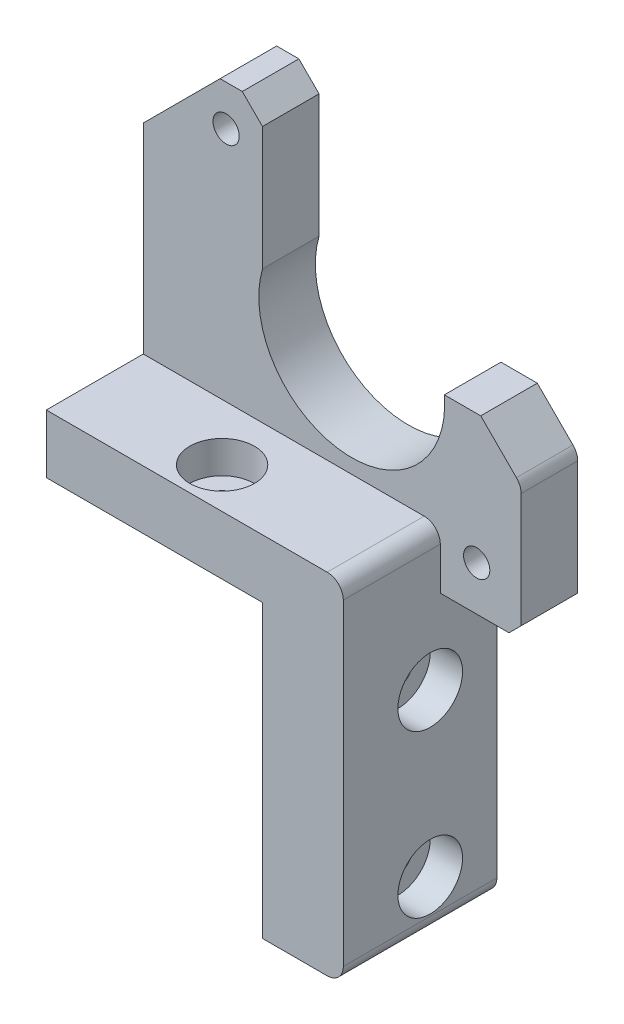
ISO-10303-21;
HEADER;
FILE_DESCRIPTION(('STEP AP214'),'2;1');
FILE_NAME('part.step','',(''),(''),'','','');
FILE_SCHEMA(('AUTOMOTIVE_DESIGN { 1 0 10303 214 1 1 1 1 }'));
ENDSEC;
DATA;
#1=APPLICATION_CONTEXT('core data for automotive mechanical design processes');
#2=APPLICATION_PROTOCOL_DEFINITION('international standard','automotive_design',2000,#1);
#3=PRODUCT_CONTEXT('',#1,'mechanical');
#4=PRODUCT('Part','Part','',(#3));
#5=PRODUCT_RELATED_PRODUCT_CATEGORY('part','',(#4));
#6=PRODUCT_DEFINITION_FORMATION('','',#4);
#7=PRODUCT_DEFINITION_CONTEXT('part definition',#1,'design');
#8=PRODUCT_DEFINITION('design','',#6,#7);
#9=PRODUCT_DEFINITION_SHAPE('','',#8);
#10=(LENGTH_UNIT() NAMED_UNIT(*) SI_UNIT(.MILLI.,.METRE.));
#11=(NAMED_UNIT(*) PLANE_ANGLE_UNIT() SI_UNIT($,.RADIAN.));
#12=(NAMED_UNIT(*) SI_UNIT($,.STERADIAN.) SOLID_ANGLE_UNIT());
#13=UNCERTAINTY_MEASURE_WITH_UNIT(LENGTH_MEASURE(1.E-05),#10,'distance_accuracy_value','');
#14=(GEOMETRIC_REPRESENTATION_CONTEXT(3) GLOBAL_UNCERTAINTY_ASSIGNED_CONTEXT((#13)) GLOBAL_UNIT_ASSIGNED_CONTEXT((#10,
#11,#12)) REPRESENTATION_CONTEXT('',''));
#15=CARTESIAN_POINT('',(0.,0.,0.));
#16=DIRECTION('',(0.,0.,1.));
#17=DIRECTION('',(1.,0.,0.));
#18=AXIS2_PLACEMENT_3D('',#15,#16,#17);
#19=CARTESIAN_POINT('',(-10.,46.,14.));
#20=DIRECTION('',(0.,-1.,0.));
#21=DIRECTION('',(0.,0.,-1.));
#22=AXIS2_PLACEMENT_3D('',#19,#20,#21);
#23=CYLINDRICAL_SURFACE('',#22,1.75);
#24=CARTESIAN_POINT('',(-10.,36.,14.));
#25=DIRECTION('',(0.,-1.,0.));
#26=DIRECTION('',(0.,0.,-1.));
#27=AXIS2_PLACEMENT_3D('',#24,#25,#26);
#28=CIRCLE('',#27,1.75);
#29=CARTESIAN_POINT('',(-10.,36.,12.25));
#30=VERTEX_POINT('',#29);
#31=EDGE_CURVE('E484',#30,#30,#28,.T.);
#32=ORIENTED_EDGE('',*,*,#31,.T.);
#33=EDGE_LOOP('',(#32));
#34=FACE_BOUND('',#33,.T.);
#35=CARTESIAN_POINT('',(-10.,39.25,14.));
#36=DIRECTION('',(0.,1.,0.));
#37=DIRECTION('',(-1.,0.,0.));
#38=AXIS2_PLACEMENT_3D('',#35,#36,#37);
#39=CIRCLE('',#38,1.75);
#40=CARTESIAN_POINT('',(-11.75,39.25,14.));
#41=VERTEX_POINT('',#40);
#42=EDGE_CURVE('E36',#41,#41,#39,.F.);
#43=ORIENTED_EDGE('',*,*,#42,.F.);
#44=EDGE_LOOP('',(#43));
#45=FACE_BOUND('',#44,.T.);
#46=ADVANCED_FACE('F32',(#34,#45),#23,.F.);
#47=CARTESIAN_POINT('',(-26.75,6.25,8.25));
#48=DIRECTION('',(1.,0.,0.));
#49=DIRECTION('',(0.,0.,-1.));
#50=AXIS2_PLACEMENT_3D('',#47,#48,#49);
#51=CYLINDRICAL_SURFACE('',#50,1.75);
#52=CARTESIAN_POINT('',(0.,6.25,8.25));
#53=DIRECTION('',(1.,0.,0.));
#54=DIRECTION('',(0.,1.,0.));
#55=AXIS2_PLACEMENT_3D('',#52,#53,#54);
#56=CIRCLE('',#55,1.75);
#57=CARTESIAN_POINT('',(0.,8.,8.25));
#58=VERTEX_POINT('',#57);
#59=EDGE_CURVE('E318',#58,#58,#56,.T.);
#60=ORIENTED_EDGE('',*,*,#59,.F.);
#61=EDGE_LOOP('',(#60));
#62=FACE_BOUND('',#61,.T.);
#63=CARTESIAN_POINT('',(6.,6.25,8.25));
#64=DIRECTION('',(1.,0.,0.));
#65=DIRECTION('',(0.,0.,-1.));
#66=AXIS2_PLACEMENT_3D('',#63,#64,#65);
#67=CIRCLE('',#66,1.75);
#68=CARTESIAN_POINT('',(6.,6.25,6.5));
#69=VERTEX_POINT('',#68);
#70=EDGE_CURVE('E314',#69,#69,#67,.F.);
#71=ORIENTED_EDGE('',*,*,#70,.F.);
#72=EDGE_LOOP('',(#71));
#73=FACE_BOUND('',#72,.T.);
#74=ADVANCED_FACE('F393',(#62,#73),#51,.F.);
#75=CARTESIAN_POINT('',(-26.75,26.25,8.25));
#76=DIRECTION('',(1.,0.,0.));
#77=DIRECTION('',(0.,0.,-1.));
#78=AXIS2_PLACEMENT_3D('',#75,#76,#77);
#79=CYLINDRICAL_SURFACE('',#78,1.75);
#80=CARTESIAN_POINT('',(0.,26.25,8.25));
#81=DIRECTION('',(1.,0.,0.));
#82=DIRECTION('',(0.,1.,0.));
#83=AXIS2_PLACEMENT_3D('',#80,#81,#82);
#84=CIRCLE('',#83,1.75);
#85=CARTESIAN_POINT('',(0.,28.,8.25));
#86=VERTEX_POINT('',#85);
#87=EDGE_CURVE('E225',#86,#86,#84,.T.);
#88=ORIENTED_EDGE('',*,*,#87,.F.);
#89=EDGE_LOOP('',(#88));
#90=FACE_BOUND('',#89,.T.);
#91=CARTESIAN_POINT('',(6.,26.25,8.25));
#92=DIRECTION('',(1.,0.,0.));
#93=DIRECTION('',(0.,0.,-1.));
#94=AXIS2_PLACEMENT_3D('',#91,#92,#93);
#95=CIRCLE('',#94,1.75);
#96=CARTESIAN_POINT('',(6.,26.25,6.5));
#97=VERTEX_POINT('',#96);
#98=EDGE_CURVE('E311',#97,#97,#95,.F.);
#99=ORIENTED_EDGE('',*,*,#98,.F.);
#100=EDGE_LOOP('',(#99));
#101=FACE_BOUND('',#100,.T.);
#102=ADVANCED_FACE('F399',(#90,#101),#79,.F.);
#103=CARTESIAN_POINT('',(10.,43.25,19.));
#104=DIRECTION('',(0.,-1.,0.));
#105=DIRECTION('',(1.,0.,0.));
#106=AXIS2_PLACEMENT_3D('',#103,#104,#105);
#107=PLANE('',#106);
#108=CARTESIAN_POINT('',(-10.,43.25,14.));
#109=DIRECTION('',(0.,1.,0.));
#110=DIRECTION('',(-1.,0.,0.));
#111=AXIS2_PLACEMENT_3D('',#108,#109,#110);
#112=CIRCLE('',#111,4.);
#113=CARTESIAN_POINT('',(-14.,43.25,14.));
#114=VERTEX_POINT('',#113);
#115=EDGE_CURVE('E541',#114,#114,#112,.T.);
#116=ORIENTED_EDGE('',*,*,#115,.F.);
#117=EDGE_LOOP('',(#116));
#118=FACE_BOUND('',#117,.T.);
#119=DIRECTION('',(-1.,0.,0.));
#120=VECTOR('',#119,1.);
#121=CARTESIAN_POINT('',(10.,43.25,19.));
#122=LINE('',#121,#120);
#123=CARTESIAN_POINT('',(8.,43.25,19.));
#124=VERTEX_POINT('',#123);
#125=CARTESIAN_POINT('',(-26.75,43.25,19.));
#126=VERTEX_POINT('',#125);
#127=EDGE_CURVE('E285',#124,#126,#122,.T.);
#128=ORIENTED_EDGE('',*,*,#127,.F.);
#129=DIRECTION('',(0.,0.,-1.));
#130=VECTOR('',#129,1.);
#131=CARTESIAN_POINT('',(8.,43.25,19.));
#132=LINE('',#131,#130);
#133=CARTESIAN_POINT('',(8.,43.25,7.));
#134=VERTEX_POINT('',#133);
#135=EDGE_CURVE('E41',#124,#134,#132,.T.);
#136=ORIENTED_EDGE('',*,*,#135,.T.);
#137=DIRECTION('',(1.,0.,0.));
#138=VECTOR('',#137,1.);
#139=CARTESIAN_POINT('',(10.,43.25,7.));
#140=LINE('',#139,#138);
#141=CARTESIAN_POINT('',(-26.75,43.25,7.));
#142=VERTEX_POINT('',#141);
#143=EDGE_CURVE('E270',#142,#134,#140,.T.);
#144=ORIENTED_EDGE('',*,*,#143,.F.);
#145=DIRECTION('',(0.,0.,-1.));
#146=VECTOR('',#145,1.);
#147=CARTESIAN_POINT('',(-26.75,43.25,19.));
#148=LINE('',#147,#146);
#149=EDGE_CURVE('E179',#126,#142,#148,.T.);
#150=ORIENTED_EDGE('',*,*,#149,.F.);
#151=EDGE_LOOP('',(#128,#136,#144,#150));
#152=FACE_BOUND('',#151,.T.);
#153=ADVANCED_FACE('F349',(#118,#152),#107,.F.);
#154=CARTESIAN_POINT('',(0.,36.,19.));
#155=DIRECTION('',(1.,0.,0.));
#156=DIRECTION('',(0.,1.,0.));
#157=AXIS2_PLACEMENT_3D('',#154,#155,#156);
#158=PLANE('',#157);
#159=ORIENTED_EDGE('',*,*,#87,.T.);
#160=EDGE_LOOP('',(#159));
#161=FACE_BOUND('',#160,.T.);
#162=ORIENTED_EDGE('',*,*,#59,.T.);
#163=EDGE_LOOP('',(#162));
#164=FACE_BOUND('',#163,.T.);
#165=DIRECTION('',(0.,-1.,0.));
#166=VECTOR('',#165,1.);
#167=CARTESIAN_POINT('',(0.,36.,0.));
#168=LINE('',#167,#166);
#169=CARTESIAN_POINT('',(0.,36.,0.));
#170=VERTEX_POINT('',#169);
#171=CARTESIAN_POINT('',(0.,0.,0.));
#172=VERTEX_POINT('',#171);
#173=EDGE_CURVE('E274',#170,#172,#168,.T.);
#174=ORIENTED_EDGE('',*,*,#173,.T.);
#175=DIRECTION('',(0.,0.,-1.));
#176=VECTOR('',#175,1.);
#177=CARTESIAN_POINT('',(0.,0.,19.));
#178=LINE('',#177,#176);
#179=CARTESIAN_POINT('',(0.,0.,19.));
#180=VERTEX_POINT('',#179);
#181=EDGE_CURVE('E307',#180,#172,#178,.T.);
#182=ORIENTED_EDGE('',*,*,#181,.F.);
#183=DIRECTION('',(0.,-1.,0.));
#184=VECTOR('',#183,1.);
#185=CARTESIAN_POINT('',(0.,36.,19.));
#186=LINE('',#185,#184);
#187=CARTESIAN_POINT('',(0.,36.,19.));
#188=VERTEX_POINT('',#187);
#189=EDGE_CURVE('E275',#188,#180,#186,.T.);
#190=ORIENTED_EDGE('',*,*,#189,.F.);
#191=DIRECTION('',(0.,0.,-1.));
#192=VECTOR('',#191,1.);
#193=CARTESIAN_POINT('',(0.,36.,19.));
#194=LINE('',#193,#192);
#195=EDGE_CURVE('E291',#188,#170,#194,.T.);
#196=ORIENTED_EDGE('',*,*,#195,.T.);
#197=EDGE_LOOP('',(#174,#182,#190,#196));
#198=FACE_BOUND('',#197,.T.);
#199=ADVANCED_FACE('F374',(#161,#164,#198),#158,.F.);
#200=CARTESIAN_POINT('',(0.,0.,19.));
#201=DIRECTION('',(0.,1.,0.));
#202=DIRECTION('',(0.,0.,1.));
#203=AXIS2_PLACEMENT_3D('',#200,#201,#202);
#204=PLANE('',#203);
#205=DIRECTION('',(1.,0.,0.));
#206=VECTOR('',#205,1.);
#207=CARTESIAN_POINT('',(0.,0.,0.));
#208=LINE('',#207,#206);
#209=CARTESIAN_POINT('',(8.,0.,0.));
#210=VERTEX_POINT('',#209);
#211=EDGE_CURVE('E294',#172,#210,#208,.T.);
#212=ORIENTED_EDGE('',*,*,#211,.T.);
#213=DIRECTION('',(0.,0.,-1.));
#214=VECTOR('',#213,1.);
#215=CARTESIAN_POINT('',(8.,0.,19.));
#216=LINE('',#215,#214);
#217=CARTESIAN_POINT('',(8.,0.,19.));
#218=VERTEX_POINT('',#217);
#219=EDGE_CURVE('E335',#210,#218,#216,.F.);
#220=ORIENTED_EDGE('',*,*,#219,.T.);
#221=DIRECTION('',(1.,0.,0.));
#222=VECTOR('',#221,1.);
#223=CARTESIAN_POINT('',(0.,0.,19.));
#224=LINE('',#223,#222);
#225=EDGE_CURVE('E278',#180,#218,#224,.T.);
#226=ORIENTED_EDGE('',*,*,#225,.F.);
#227=ORIENTED_EDGE('',*,*,#181,.T.);
#228=EDGE_LOOP('',(#212,#220,#226,#227));
#229=FACE_BOUND('',#228,.T.);
#230=ADVANCED_FACE('F370',(#229),#204,.F.);
#231=CARTESIAN_POINT('',(10.,0.,19.));
#232=DIRECTION('',(-1.,0.,0.));
#233=DIRECTION('',(0.,0.,1.));
#234=AXIS2_PLACEMENT_3D('',#231,#232,#233);
#235=PLANE('',#234);
#236=CARTESIAN_POINT('',(10.,26.25,8.25));
#237=DIRECTION('',(1.,0.,0.));
#238=DIRECTION('',(0.,0.,-1.));
#239=AXIS2_PLACEMENT_3D('',#236,#237,#238);
#240=CIRCLE('',#239,4.);
#241=CARTESIAN_POINT('',(10.,26.25,4.25));
#242=VERTEX_POINT('',#241);
#243=EDGE_CURVE('E491',#242,#242,#240,.T.);
#244=ORIENTED_EDGE('',*,*,#243,.F.);
#245=EDGE_LOOP('',(#244));
#246=FACE_BOUND('',#245,.T.);
#247=CARTESIAN_POINT('',(10.,6.25,8.25));
#248=DIRECTION('',(1.,0.,0.));
#249=DIRECTION('',(0.,0.,-1.));
#250=AXIS2_PLACEMENT_3D('',#247,#248,#249);
#251=CIRCLE('',#250,4.);
#252=CARTESIAN_POINT('',(10.,6.25,4.25));
#253=VERTEX_POINT('',#252);
#254=EDGE_CURVE('E326',#253,#253,#251,.T.);
#255=ORIENTED_EDGE('',*,*,#254,.F.);
#256=EDGE_LOOP('',(#255));
#257=FACE_BOUND('',#256,.T.);
#258=DIRECTION('',(0.,1.,0.));
#259=VECTOR('',#258,1.);
#260=CARTESIAN_POINT('',(10.,0.,19.));
#261=LINE('',#260,#259);
#262=CARTESIAN_POINT('',(10.,2.,19.));
#263=VERTEX_POINT('',#262);
#264=CARTESIAN_POINT('',(10.,41.25,19.));
#265=VERTEX_POINT('',#264);
#266=EDGE_CURVE('E282',#263,#265,#261,.T.);
#267=ORIENTED_EDGE('',*,*,#266,.F.);
#268=DIRECTION('',(0.,0.,-1.));
#269=VECTOR('',#268,1.);
#270=CARTESIAN_POINT('',(10.,2.,19.));
#271=LINE('',#270,#269);
#272=CARTESIAN_POINT('',(10.,2.,0.));
#273=VERTEX_POINT('',#272);
#274=EDGE_CURVE('E328',#263,#273,#271,.T.);
#275=ORIENTED_EDGE('',*,*,#274,.T.);
#276=DIRECTION('',(0.,1.,0.));
#277=VECTOR('',#276,1.);
#278=CARTESIAN_POINT('',(10.,0.,0.));
#279=LINE('',#278,#277);
#280=CARTESIAN_POINT('',(10.,36.,0.));
#281=VERTEX_POINT('',#280);
#282=EDGE_CURVE('E297',#273,#281,#279,.T.);
#283=ORIENTED_EDGE('',*,*,#282,.T.);
#284=DIRECTION('',(0.,0.,1.));
#285=VECTOR('',#284,1.);
#286=CARTESIAN_POINT('',(10.,36.,19.));
#287=LINE('',#286,#285);
#288=CARTESIAN_POINT('',(10.,36.,7.));
#289=VERTEX_POINT('',#288);
#290=EDGE_CURVE('E253',#281,#289,#287,.T.);
#291=ORIENTED_EDGE('',*,*,#290,.T.);
#292=DIRECTION('',(0.,-1.,0.));
#293=VECTOR('',#292,1.);
#294=CARTESIAN_POINT('',(10.,0.,7.));
#295=LINE('',#294,#293);
#296=CARTESIAN_POINT('',(10.,41.25,7.));
#297=VERTEX_POINT('',#296);
#298=EDGE_CURVE('E272',#297,#289,#295,.T.);
#299=ORIENTED_EDGE('',*,*,#298,.F.);
#300=DIRECTION('',(0.,0.,-1.));
#301=VECTOR('',#300,1.);
#302=CARTESIAN_POINT('',(10.,41.25,19.));
#303=LINE('',#302,#301);
#304=EDGE_CURVE('E310',#297,#265,#303,.F.);
#305=ORIENTED_EDGE('',*,*,#304,.T.);
#306=EDGE_LOOP('',(#267,#275,#283,#291,#299,#305));
#307=FACE_BOUND('',#306,.T.);
#308=ADVANCED_FACE('F355',(#246,#257,#307),#235,.F.);
#309=CARTESIAN_POINT('',(-26.75,43.25,19.));
#310=DIRECTION('',(1.,0.,0.));
#311=DIRECTION('',(0.,1.,0.));
#312=AXIS2_PLACEMENT_3D('',#309,#310,#311);
#313=PLANE('',#312);
#314=DIRECTION('',(0.,-1.,0.));
#315=VECTOR('',#314,1.);
#316=CARTESIAN_POINT('',(-26.75,43.25,0.));
#317=LINE('',#316,#315);
#318=CARTESIAN_POINT('',(-26.75,68.,0.));
#319=VERTEX_POINT('',#318);
#320=CARTESIAN_POINT('',(-26.75,36.,0.));
#321=VERTEX_POINT('',#320);
#322=EDGE_CURVE('E299',#319,#321,#317,.T.);
#323=ORIENTED_EDGE('',*,*,#322,.T.);
#324=DIRECTION('',(0.,0.,-1.));
#325=VECTOR('',#324,1.);
#326=CARTESIAN_POINT('',(-26.75,36.,19.));
#327=LINE('',#326,#325);
#328=CARTESIAN_POINT('',(-26.75,36.,19.));
#329=VERTEX_POINT('',#328);
#330=EDGE_CURVE('E304',#329,#321,#327,.T.);
#331=ORIENTED_EDGE('',*,*,#330,.F.);
#332=DIRECTION('',(0.,-1.,0.));
#333=VECTOR('',#332,1.);
#334=CARTESIAN_POINT('',(-26.75,43.25,19.));
#335=LINE('',#334,#333);
#336=EDGE_CURVE('E287',#126,#329,#335,.T.);
#337=ORIENTED_EDGE('',*,*,#336,.F.);
#338=ORIENTED_EDGE('',*,*,#149,.T.);
#339=DIRECTION('',(0.,1.,0.));
#340=VECTOR('',#339,1.);
#341=CARTESIAN_POINT('',(-26.75,36.,7.));
#342=LINE('',#341,#340);
#343=CARTESIAN_POINT('',(-26.75,68.,7.));
#344=VERTEX_POINT('',#343);
#345=EDGE_CURVE('E171',#142,#344,#342,.T.);
#346=ORIENTED_EDGE('',*,*,#345,.T.);
#347=DIRECTION('',(0.,0.,-1.));
#348=VECTOR('',#347,1.);
#349=CARTESIAN_POINT('',(-26.75,68.,7.));
#350=LINE('',#349,#348);
#351=EDGE_CURVE('E175',#344,#319,#350,.T.);
#352=ORIENTED_EDGE('',*,*,#351,.T.);
#353=EDGE_LOOP('',(#323,#331,#337,#338,#346,#352));
#354=FACE_BOUND('',#353,.T.);
#355=ADVANCED_FACE('F174',(#354),#313,.F.);
#356=CARTESIAN_POINT('',(-26.75,36.,19.));
#357=DIRECTION('',(0.,1.,0.));
#358=DIRECTION('',(0.,0.,1.));
#359=AXIS2_PLACEMENT_3D('',#356,#357,#358);
#360=PLANE('',#359);
#361=ORIENTED_EDGE('',*,*,#31,.F.);
#362=EDGE_LOOP('',(#361));
#363=FACE_BOUND('',#362,.T.);
#364=DIRECTION('',(1.,0.,0.));
#365=VECTOR('',#364,1.);
#366=CARTESIAN_POINT('',(-26.75,36.,0.));
#367=LINE('',#366,#365);
#368=EDGE_CURVE('E279',#321,#170,#367,.T.);
#369=ORIENTED_EDGE('',*,*,#368,.T.);
#370=ORIENTED_EDGE('',*,*,#195,.F.);
#371=DIRECTION('',(1.,0.,0.));
#372=VECTOR('',#371,1.);
#373=CARTESIAN_POINT('',(-26.75,36.,19.));
#374=LINE('',#373,#372);
#375=EDGE_CURVE('E289',#329,#188,#374,.T.);
#376=ORIENTED_EDGE('',*,*,#375,.F.);
#377=ORIENTED_EDGE('',*,*,#330,.T.);
#378=EDGE_LOOP('',(#369,#370,#376,#377));
#379=FACE_BOUND('',#378,.T.);
#380=ADVANCED_FACE('F378',(#363,#379),#360,.F.);
#381=CARTESIAN_POINT('',(0.,0.,19.));
#382=DIRECTION('',(0.,0.,1.));
#383=DIRECTION('',(1.,0.,0.));
#384=AXIS2_PLACEMENT_3D('',#381,#382,#383);
#385=PLANE('',#384);
#386=ORIENTED_EDGE('',*,*,#225,.T.);
#387=CARTESIAN_POINT('',(8.,2.,19.));
#388=DIRECTION('',(0.,0.,1.));
#389=DIRECTION('',(1.,0.,0.));
#390=AXIS2_PLACEMENT_3D('',#387,#388,#389);
#391=CIRCLE('',#390,2.);
#392=EDGE_CURVE('E339',#218,#263,#391,.T.);
#393=ORIENTED_EDGE('',*,*,#392,.T.);
#394=ORIENTED_EDGE('',*,*,#266,.T.);
#395=CARTESIAN_POINT('',(8.,41.25,19.));
#396=DIRECTION('',(0.,0.,1.));
#397=DIRECTION('',(1.,0.,0.));
#398=AXIS2_PLACEMENT_3D('',#395,#396,#397);
#399=CIRCLE('',#398,2.);
#400=EDGE_CURVE('E337',#265,#124,#399,.T.);
#401=ORIENTED_EDGE('',*,*,#400,.T.);
#402=ORIENTED_EDGE('',*,*,#127,.T.);
#403=ORIENTED_EDGE('',*,*,#336,.T.);
#404=ORIENTED_EDGE('',*,*,#375,.T.);
#405=ORIENTED_EDGE('',*,*,#189,.T.);
#406=EDGE_LOOP('',(#386,#393,#394,#401,#402,#403,#404,#405));
#407=FACE_BOUND('',#406,.T.);
#408=ADVANCED_FACE('F359',(#407),#385,.T.);
#409=CARTESIAN_POINT('',(0.,0.,0.));
#410=DIRECTION('',(0.,0.,1.));
#411=DIRECTION('',(1.,0.,0.));
#412=AXIS2_PLACEMENT_3D('',#409,#410,#411);
#413=PLANE('',#412);
#414=CARTESIAN_POINT('',(-16.5,72.5,0.));
#415=DIRECTION('',(0.,0.,-1.));
#416=DIRECTION('',(-1.,0.,0.));
#417=AXIS2_PLACEMENT_3D('',#414,#415,#416);
#418=CIRCLE('',#417,1.625);
#419=CARTESIAN_POINT('',(-18.125,72.5,0.));
#420=VERTEX_POINT('',#419);
#421=EDGE_CURVE('E323',#420,#420,#418,.T.);
#422=ORIENTED_EDGE('',*,*,#421,.F.);
#423=EDGE_LOOP('',(#422));
#424=FACE_BOUND('',#423,.T.);
#425=CARTESIAN_POINT('',(14.5,41.5,0.));
#426=DIRECTION('',(0.,0.,-1.));
#427=DIRECTION('',(-1.,0.,0.));
#428=AXIS2_PLACEMENT_3D('',#425,#426,#427);
#429=CIRCLE('',#428,1.625);
#430=CARTESIAN_POINT('',(12.875,41.5,0.));
#431=VERTEX_POINT('',#430);
#432=EDGE_CURVE('E483',#431,#431,#429,.T.);
#433=ORIENTED_EDGE('',*,*,#432,.F.);
#434=EDGE_LOOP('',(#433));
#435=FACE_BOUND('',#434,.T.);
#436=ORIENTED_EDGE('',*,*,#282,.F.);
#437=CARTESIAN_POINT('',(8.,2.,0.));
#438=DIRECTION('',(0.,0.,1.));
#439=DIRECTION('',(1.,0.,0.));
#440=AXIS2_PLACEMENT_3D('',#437,#438,#439);
#441=CIRCLE('',#440,2.);
#442=EDGE_CURVE('E333',#273,#210,#441,.F.);
#443=ORIENTED_EDGE('',*,*,#442,.T.);
#444=ORIENTED_EDGE('',*,*,#211,.F.);
#445=ORIENTED_EDGE('',*,*,#173,.F.);
#446=ORIENTED_EDGE('',*,*,#368,.F.);
#447=ORIENTED_EDGE('',*,*,#322,.F.);
#448=DIRECTION('',(0.707106781186549,0.707106781186546,0.));
#449=VECTOR('',#448,1.);
#450=CARTESIAN_POINT('',(-26.75,68.,0.));
#451=LINE('',#450,#449);
#452=CARTESIAN_POINT('',(-17.25,77.5,0.));
#453=VERTEX_POINT('',#452);
#454=EDGE_CURVE('E190',#319,#453,#451,.T.);
#455=ORIENTED_EDGE('',*,*,#454,.T.);
#456=DIRECTION('',(1.,0.,0.));
#457=VECTOR('',#456,1.);
#458=CARTESIAN_POINT('',(-17.25,77.5,0.));
#459=LINE('',#458,#457);
#460=CARTESIAN_POINT('',(-14.5,77.5,0.));
#461=VERTEX_POINT('',#460);
#462=EDGE_CURVE('E227',#453,#461,#459,.T.);
#463=ORIENTED_EDGE('',*,*,#462,.T.);
#464=DIRECTION('',(0.707106781186547,-0.707106781186549,0.));
#465=VECTOR('',#464,1.);
#466=CARTESIAN_POINT('',(-14.5,77.5,0.));
#467=LINE('',#466,#465);
#468=CARTESIAN_POINT('',(-12.,75.,0.));
#469=VERTEX_POINT('',#468);
#470=EDGE_CURVE('E230',#461,#469,#467,.T.);
#471=ORIENTED_EDGE('',*,*,#470,.T.);
#472=DIRECTION('',(0.,-1.,0.));
#473=VECTOR('',#472,1.);
#474=CARTESIAN_POINT('',(-12.,75.,0.));
#475=LINE('',#474,#473);
#476=CARTESIAN_POINT('',(-12.,59.75,0.));
#477=VERTEX_POINT('',#476);
#478=EDGE_CURVE('E233',#469,#477,#475,.T.);
#479=ORIENTED_EDGE('',*,*,#478,.T.);
#480=CARTESIAN_POINT('',(-0.959238955727776,56.5326104427221,0.));
#481=DIRECTION('',(0.,0.,1.));
#482=DIRECTION('',(-1.,0.,0.));
#483=AXIS2_PLACEMENT_3D('',#480,#481,#482);
#484=CIRCLE('',#483,11.5);
#485=CARTESIAN_POINT('',(10.5,57.5,0.));
#486=VERTEX_POINT('',#485);
#487=EDGE_CURVE('E236',#477,#486,#484,.T.);
#488=ORIENTED_EDGE('',*,*,#487,.T.);
#489=DIRECTION('',(1.,0.,0.));
#490=VECTOR('',#489,1.);
#491=CARTESIAN_POINT('',(15.,57.5,0.));
#492=LINE('',#491,#490);
#493=CARTESIAN_POINT('',(15.,57.5,0.));
#494=VERTEX_POINT('',#493);
#495=EDGE_CURVE('E239',#486,#494,#492,.T.);
#496=ORIENTED_EDGE('',*,*,#495,.T.);
#497=DIRECTION('',(0.707106781186546,-0.707106781186549,0.));
#498=VECTOR('',#497,1.);
#499=CARTESIAN_POINT('',(20.,52.5,0.));
#500=LINE('',#499,#498);
#501=CARTESIAN_POINT('',(19.4142135623731,53.0857864376269,0.));
#502=VERTEX_POINT('',#501);
#503=EDGE_CURVE('E242',#494,#502,#500,.T.);
#504=ORIENTED_EDGE('',*,*,#503,.T.);
#505=CARTESIAN_POINT('',(18.,51.6715728752538,0.));
#506=DIRECTION('',(0.,0.,1.));
#507=DIRECTION('',(1.,0.,0.));
#508=AXIS2_PLACEMENT_3D('',#505,#506,#507);
#509=CIRCLE('',#508,2.);
#510=CARTESIAN_POINT('',(20.,51.6715728752538,0.));
#511=VERTEX_POINT('',#510);
#512=EDGE_CURVE('E331',#502,#511,#509,.F.);
#513=ORIENTED_EDGE('',*,*,#512,.T.);
#514=DIRECTION('',(0.,-1.,0.));
#515=VECTOR('',#514,1.);
#516=CARTESIAN_POINT('',(20.,37.5,0.));
#517=LINE('',#516,#515);
#518=CARTESIAN_POINT('',(20.,37.5,0.));
#519=VERTEX_POINT('',#518);
#520=EDGE_CURVE('E245',#511,#519,#517,.T.);
#521=ORIENTED_EDGE('',*,*,#520,.T.);
#522=DIRECTION('',(-0.707106781186549,-0.707106781186546,0.));
#523=VECTOR('',#522,1.);
#524=CARTESIAN_POINT('',(18.5,36.,0.));
#525=LINE('',#524,#523);
#526=CARTESIAN_POINT('',(18.5,36.,0.));
#527=VERTEX_POINT('',#526);
#528=EDGE_CURVE('E247',#519,#527,#525,.T.);
#529=ORIENTED_EDGE('',*,*,#528,.T.);
#530=DIRECTION('',(-1.,0.,0.));
#531=VECTOR('',#530,1.);
#532=CARTESIAN_POINT('',(10.,36.,0.));
#533=LINE('',#532,#531);
#534=EDGE_CURVE('E222',#527,#281,#533,.T.);
#535=ORIENTED_EDGE('',*,*,#534,.T.);
#536=EDGE_LOOP('',(#436,#443,#444,#445,#446,#447,#455,#463,#471,#479,#488,#496,#504,#513,#521,
#529,#535));
#537=FACE_BOUND('',#536,.T.);
#538=ADVANCED_FACE('F367',(#424,#435,#537),#413,.F.);
#539=CARTESIAN_POINT('',(-0.959238955727776,56.5326104427221,7.));
#540=DIRECTION('',(0.,0.,-1.));
#541=DIRECTION('',(-1.,0.,0.));
#542=AXIS2_PLACEMENT_3D('',#539,#540,#541);
#543=PLANE('',#542);
#544=CARTESIAN_POINT('',(-16.5,72.5,7.));
#545=DIRECTION('',(0.,0.,-1.));
#546=DIRECTION('',(-1.,0.,0.));
#547=AXIS2_PLACEMENT_3D('',#544,#545,#546);
#548=CIRCLE('',#547,1.625);
#549=CARTESIAN_POINT('',(-18.125,72.5,7.));
#550=VERTEX_POINT('',#549);
#551=EDGE_CURVE('E322',#550,#550,#548,.T.);
#552=ORIENTED_EDGE('',*,*,#551,.T.);
#553=EDGE_LOOP('',(#552));
#554=FACE_BOUND('',#553,.T.);
#555=CARTESIAN_POINT('',(14.5,41.5,7.));
#556=DIRECTION('',(0.,0.,-1.));
#557=DIRECTION('',(-1.,0.,0.));
#558=AXIS2_PLACEMENT_3D('',#555,#556,#557);
#559=CIRCLE('',#558,1.625);
#560=CARTESIAN_POINT('',(12.875,41.5,7.));
#561=VERTEX_POINT('',#560);
#562=EDGE_CURVE('E319',#561,#561,#559,.T.);
#563=ORIENTED_EDGE('',*,*,#562,.T.);
#564=EDGE_LOOP('',(#563));
#565=FACE_BOUND('',#564,.T.);
#566=DIRECTION('',(0.,-1.,0.));
#567=VECTOR('',#566,1.);
#568=CARTESIAN_POINT('',(20.,37.5,7.));
#569=LINE('',#568,#567);
#570=CARTESIAN_POINT('',(20.,51.6715728752538,7.));
#571=VERTEX_POINT('',#570);
#572=CARTESIAN_POINT('',(20.,37.5,7.));
#573=VERTEX_POINT('',#572);
#574=EDGE_CURVE('E218',#571,#573,#569,.T.);
#575=ORIENTED_EDGE('',*,*,#574,.F.);
#576=CARTESIAN_POINT('',(18.,51.6715728752538,7.));
#577=DIRECTION('',(0.,0.,-1.));
#578=DIRECTION('',(-1.,0.,0.));
#579=AXIS2_PLACEMENT_3D('',#576,#577,#578);
#580=CIRCLE('',#579,2.);
#581=CARTESIAN_POINT('',(19.4142135623731,53.0857864376269,7.));
#582=VERTEX_POINT('',#581);
#583=EDGE_CURVE('E345',#571,#582,#580,.F.);
#584=ORIENTED_EDGE('',*,*,#583,.T.);
#585=DIRECTION('',(0.707106781186546,-0.707106781186549,0.));
#586=VECTOR('',#585,1.);
#587=CARTESIAN_POINT('',(20.,52.5,7.));
#588=LINE('',#587,#586);
#589=CARTESIAN_POINT('',(15.,57.5,7.));
#590=VERTEX_POINT('',#589);
#591=EDGE_CURVE('E215',#590,#582,#588,.T.);
#592=ORIENTED_EDGE('',*,*,#591,.F.);
#593=DIRECTION('',(1.,0.,0.));
#594=VECTOR('',#593,1.);
#595=CARTESIAN_POINT('',(15.,57.5,7.));
#596=LINE('',#595,#594);
#597=CARTESIAN_POINT('',(10.5,57.5,7.));
#598=VERTEX_POINT('',#597);
#599=EDGE_CURVE('E212',#598,#590,#596,.T.);
#600=ORIENTED_EDGE('',*,*,#599,.F.);
#601=CARTESIAN_POINT('',(-0.959238955727776,56.5326104427221,7.));
#602=DIRECTION('',(0.,0.,1.));
#603=DIRECTION('',(-1.,0.,0.));
#604=AXIS2_PLACEMENT_3D('',#601,#602,#603);
#605=CIRCLE('',#604,11.5);
#606=CARTESIAN_POINT('',(-12.,59.75,7.));
#607=VERTEX_POINT('',#606);
#608=EDGE_CURVE('E209',#607,#598,#605,.T.);
#609=ORIENTED_EDGE('',*,*,#608,.F.);
#610=DIRECTION('',(0.,-1.,0.));
#611=VECTOR('',#610,1.);
#612=CARTESIAN_POINT('',(-12.,75.,7.));
#613=LINE('',#612,#611);
#614=CARTESIAN_POINT('',(-12.,75.,7.));
#615=VERTEX_POINT('',#614);
#616=EDGE_CURVE('E206',#615,#607,#613,.T.);
#617=ORIENTED_EDGE('',*,*,#616,.F.);
#618=DIRECTION('',(0.707106781186547,-0.707106781186549,0.));
#619=VECTOR('',#618,1.);
#620=CARTESIAN_POINT('',(-14.5,77.5,7.));
#621=LINE('',#620,#619);
#622=CARTESIAN_POINT('',(-14.5,77.5,7.));
#623=VERTEX_POINT('',#622);
#624=EDGE_CURVE('E200',#623,#615,#621,.T.);
#625=ORIENTED_EDGE('',*,*,#624,.F.);
#626=DIRECTION('',(1.,0.,0.));
#627=VECTOR('',#626,1.);
#628=CARTESIAN_POINT('',(-17.25,77.5,7.));
#629=LINE('',#628,#627);
#630=CARTESIAN_POINT('',(-17.25,77.5,7.));
#631=VERTEX_POINT('',#630);
#632=EDGE_CURVE('E198',#631,#623,#629,.T.);
#633=ORIENTED_EDGE('',*,*,#632,.F.);
#634=DIRECTION('',(0.707106781186549,0.707106781186546,0.));
#635=VECTOR('',#634,1.);
#636=CARTESIAN_POINT('',(-26.75,68.,7.));
#637=LINE('',#636,#635);
#638=EDGE_CURVE('E183',#344,#631,#637,.T.);
#639=ORIENTED_EDGE('',*,*,#638,.F.);
#640=ORIENTED_EDGE('',*,*,#345,.F.);
#641=ORIENTED_EDGE('',*,*,#143,.T.);
#642=CARTESIAN_POINT('',(8.,41.25,7.));
#643=DIRECTION('',(0.,0.,-1.));
#644=DIRECTION('',(-1.,0.,0.));
#645=AXIS2_PLACEMENT_3D('',#642,#643,#644);
#646=CIRCLE('',#645,2.);
#647=EDGE_CURVE('E11',#134,#297,#646,.T.);
#648=ORIENTED_EDGE('',*,*,#647,.T.);
#649=ORIENTED_EDGE('',*,*,#298,.T.);
#650=DIRECTION('',(-1.,0.,0.));
#651=VECTOR('',#650,1.);
#652=CARTESIAN_POINT('',(10.,36.,7.));
#653=LINE('',#652,#651);
#654=CARTESIAN_POINT('',(18.5,36.,7.));
#655=VERTEX_POINT('',#654);
#656=EDGE_CURVE('E184',#655,#289,#653,.T.);
#657=ORIENTED_EDGE('',*,*,#656,.F.);
#658=DIRECTION('',(-0.707106781186549,-0.707106781186546,0.));
#659=VECTOR('',#658,1.);
#660=CARTESIAN_POINT('',(18.5,36.,7.));
#661=LINE('',#660,#659);
#662=EDGE_CURVE('E192',#573,#655,#661,.T.);
#663=ORIENTED_EDGE('',*,*,#662,.F.);
#664=EDGE_LOOP('',(#575,#584,#592,#600,#609,#617,#625,#633,#639,#640,#641,#648,#649,#657,#663));
#665=FACE_BOUND('',#664,.T.);
#666=ADVANCED_FACE('F195',(#554,#565,#665),#543,.F.);
#667=CARTESIAN_POINT('',(10.,36.,7.));
#668=DIRECTION('',(0.,-1.,0.));
#669=DIRECTION('',(0.,0.,-1.));
#670=AXIS2_PLACEMENT_3D('',#667,#668,#669);
#671=PLANE('',#670);
#672=ORIENTED_EDGE('',*,*,#290,.F.);
#673=ORIENTED_EDGE('',*,*,#534,.F.);
#674=DIRECTION('',(0.,0.,-1.));
#675=VECTOR('',#674,1.);
#676=CARTESIAN_POINT('',(18.5,36.,7.));
#677=LINE('',#676,#675);
#678=EDGE_CURVE('E250',#655,#527,#677,.T.);
#679=ORIENTED_EDGE('',*,*,#678,.F.);
#680=ORIENTED_EDGE('',*,*,#656,.T.);
#681=EDGE_LOOP('',(#672,#673,#679,#680));
#682=FACE_BOUND('',#681,.T.);
#683=ADVANCED_FACE('F437',(#682),#671,.T.);
#684=CARTESIAN_POINT('',(18.5,36.,7.));
#685=DIRECTION('',(0.707106781186546,-0.707106781186549,0.));
#686=DIRECTION('',(0.707106781186549,0.707106781186546,0.));
#687=AXIS2_PLACEMENT_3D('',#684,#685,#686);
#688=PLANE('',#687);
#689=ORIENTED_EDGE('',*,*,#528,.F.);
#690=DIRECTION('',(0.,0.,-1.));
#691=VECTOR('',#690,1.);
#692=CARTESIAN_POINT('',(20.,37.5,7.));
#693=LINE('',#692,#691);
#694=EDGE_CURVE('E254',#573,#519,#693,.T.);
#695=ORIENTED_EDGE('',*,*,#694,.F.);
#696=ORIENTED_EDGE('',*,*,#662,.T.);
#697=ORIENTED_EDGE('',*,*,#678,.T.);
#698=EDGE_LOOP('',(#689,#695,#696,#697));
#699=FACE_BOUND('',#698,.T.);
#700=ADVANCED_FACE('F439',(#699),#688,.T.);
#701=CARTESIAN_POINT('',(20.,37.5,7.));
#702=DIRECTION('',(1.,0.,0.));
#703=DIRECTION('',(0.,1.,0.));
#704=AXIS2_PLACEMENT_3D('',#701,#702,#703);
#705=PLANE('',#704);
#706=ORIENTED_EDGE('',*,*,#520,.F.);
#707=DIRECTION('',(0.,0.,-1.));
#708=VECTOR('',#707,1.);
#709=CARTESIAN_POINT('',(20.,51.6715728752538,7.));
#710=LINE('',#709,#708);
#711=EDGE_CURVE('E54',#511,#571,#710,.F.);
#712=ORIENTED_EDGE('',*,*,#711,.T.);
#713=ORIENTED_EDGE('',*,*,#574,.T.);
#714=ORIENTED_EDGE('',*,*,#694,.T.);
#715=EDGE_LOOP('',(#706,#712,#713,#714));
#716=FACE_BOUND('',#715,.T.);
#717=ADVANCED_FACE('F442',(#716),#705,.T.);
#718=CARTESIAN_POINT('',(20.,52.5,7.));
#719=DIRECTION('',(0.707106781186549,0.707106781186547,0.));
#720=DIRECTION('',(-0.707106781186546,0.707106781186549,0.));
#721=AXIS2_PLACEMENT_3D('',#718,#719,#720);
#722=PLANE('',#721);
#723=ORIENTED_EDGE('',*,*,#591,.T.);
#724=DIRECTION('',(0.,0.,-1.));
#725=VECTOR('',#724,1.);
#726=CARTESIAN_POINT('',(19.4142135623731,53.0857864376269,7.));
#727=LINE('',#726,#725);
#728=EDGE_CURVE('E341',#582,#502,#727,.T.);
#729=ORIENTED_EDGE('',*,*,#728,.T.);
#730=ORIENTED_EDGE('',*,*,#503,.F.);
#731=DIRECTION('',(0.,0.,-1.));
#732=VECTOR('',#731,1.);
#733=CARTESIAN_POINT('',(15.,57.5,7.));
#734=LINE('',#733,#732);
#735=EDGE_CURVE('E257',#590,#494,#734,.T.);
#736=ORIENTED_EDGE('',*,*,#735,.F.);
#737=EDGE_LOOP('',(#723,#729,#730,#736));
#738=FACE_BOUND('',#737,.T.);
#739=ADVANCED_FACE('F446',(#738),#722,.T.);
#740=CARTESIAN_POINT('',(15.,57.5,7.));
#741=DIRECTION('',(0.,1.,0.));
#742=DIRECTION('',(0.,0.,1.));
#743=AXIS2_PLACEMENT_3D('',#740,#741,#742);
#744=PLANE('',#743);
#745=ORIENTED_EDGE('',*,*,#495,.F.);
#746=DIRECTION('',(0.,0.,-1.));
#747=VECTOR('',#746,1.);
#748=CARTESIAN_POINT('',(10.5,57.5,7.));
#749=LINE('',#748,#747);
#750=EDGE_CURVE('E259',#598,#486,#749,.T.);
#751=ORIENTED_EDGE('',*,*,#750,.F.);
#752=ORIENTED_EDGE('',*,*,#599,.T.);
#753=ORIENTED_EDGE('',*,*,#735,.T.);
#754=EDGE_LOOP('',(#745,#751,#752,#753));
#755=FACE_BOUND('',#754,.T.);
#756=ADVANCED_FACE('F449',(#755),#744,.T.);
#757=CARTESIAN_POINT('',(-0.959238955727776,56.5326104427221,7.));
#758=DIRECTION('',(0.,0.,-1.));
#759=DIRECTION('',(-1.,0.,0.));
#760=AXIS2_PLACEMENT_3D('',#757,#758,#759);
#761=CYLINDRICAL_SURFACE('',#760,11.5);
#762=ORIENTED_EDGE('',*,*,#487,.F.);
#763=DIRECTION('',(0.,0.,-1.));
#764=VECTOR('',#763,1.);
#765=CARTESIAN_POINT('',(-12.,59.75,7.));
#766=LINE('',#765,#764);
#767=EDGE_CURVE('E261',#607,#477,#766,.T.);
#768=ORIENTED_EDGE('',*,*,#767,.F.);
#769=ORIENTED_EDGE('',*,*,#608,.T.);
#770=ORIENTED_EDGE('',*,*,#750,.T.);
#771=EDGE_LOOP('',(#762,#768,#769,#770));
#772=FACE_BOUND('',#771,.T.);
#773=ADVANCED_FACE('F453',(#772),#761,.F.);
#774=CARTESIAN_POINT('',(-12.,75.,7.));
#775=DIRECTION('',(1.,0.,0.));
#776=DIRECTION('',(0.,0.,-1.));
#777=AXIS2_PLACEMENT_3D('',#774,#775,#776);
#778=PLANE('',#777);
#779=ORIENTED_EDGE('',*,*,#478,.F.);
#780=DIRECTION('',(0.,0.,-1.));
#781=VECTOR('',#780,1.);
#782=CARTESIAN_POINT('',(-12.,75.,7.));
#783=LINE('',#782,#781);
#784=EDGE_CURVE('E263',#615,#469,#783,.T.);
#785=ORIENTED_EDGE('',*,*,#784,.F.);
#786=ORIENTED_EDGE('',*,*,#616,.T.);
#787=ORIENTED_EDGE('',*,*,#767,.T.);
#788=EDGE_LOOP('',(#779,#785,#786,#787));
#789=FACE_BOUND('',#788,.T.);
#790=ADVANCED_FACE('F457',(#789),#778,.T.);
#791=CARTESIAN_POINT('',(-14.5,77.5,7.));
#792=DIRECTION('',(0.707106781186548,0.707106781186546,0.));
#793=DIRECTION('',(-0.707106781186547,0.707106781186549,0.));
#794=AXIS2_PLACEMENT_3D('',#791,#792,#793);
#795=PLANE('',#794);
#796=ORIENTED_EDGE('',*,*,#470,.F.);
#797=DIRECTION('',(0.,0.,-1.));
#798=VECTOR('',#797,1.);
#799=CARTESIAN_POINT('',(-14.5,77.5,7.));
#800=LINE('',#799,#798);
#801=EDGE_CURVE('E265',#623,#461,#800,.T.);
#802=ORIENTED_EDGE('',*,*,#801,.F.);
#803=ORIENTED_EDGE('',*,*,#624,.T.);
#804=ORIENTED_EDGE('',*,*,#784,.T.);
#805=EDGE_LOOP('',(#796,#802,#803,#804));
#806=FACE_BOUND('',#805,.T.);
#807=ADVANCED_FACE('F461',(#806),#795,.T.);
#808=CARTESIAN_POINT('',(-17.25,77.5,7.));
#809=DIRECTION('',(0.,1.,0.));
#810=DIRECTION('',(-1.,0.,0.));
#811=AXIS2_PLACEMENT_3D('',#808,#809,#810);
#812=PLANE('',#811);
#813=ORIENTED_EDGE('',*,*,#462,.F.);
#814=DIRECTION('',(0.,0.,-1.));
#815=VECTOR('',#814,1.);
#816=CARTESIAN_POINT('',(-17.25,77.5,7.));
#817=LINE('',#816,#815);
#818=EDGE_CURVE('E191',#631,#453,#817,.T.);
#819=ORIENTED_EDGE('',*,*,#818,.F.);
#820=ORIENTED_EDGE('',*,*,#632,.T.);
#821=ORIENTED_EDGE('',*,*,#801,.T.);
#822=EDGE_LOOP('',(#813,#819,#820,#821));
#823=FACE_BOUND('',#822,.T.);
#824=ADVANCED_FACE('F465',(#823),#812,.T.);
#825=CARTESIAN_POINT('',(-26.75,68.,7.));
#826=DIRECTION('',(-0.707106781186546,0.707106781186549,0.));
#827=DIRECTION('',(-0.707106781186549,-0.707106781186546,0.));
#828=AXIS2_PLACEMENT_3D('',#825,#826,#827);
#829=PLANE('',#828);
#830=ORIENTED_EDGE('',*,*,#454,.F.);
#831=ORIENTED_EDGE('',*,*,#351,.F.);
#832=ORIENTED_EDGE('',*,*,#638,.T.);
#833=ORIENTED_EDGE('',*,*,#818,.T.);
#834=EDGE_LOOP('',(#830,#831,#832,#833));
#835=FACE_BOUND('',#834,.T.);
#836=ADVANCED_FACE('F188',(#835),#829,.T.);
#837=CARTESIAN_POINT('',(6.,26.25,8.25));
#838=DIRECTION('',(1.,0.,0.));
#839=DIRECTION('',(0.,0.,-1.));
#840=AXIS2_PLACEMENT_3D('',#837,#838,#839);
#841=PLANE('',#840);
#842=CARTESIAN_POINT('',(6.,26.25,8.25));
#843=DIRECTION('',(1.,0.,0.));
#844=DIRECTION('',(0.,0.,-1.));
#845=AXIS2_PLACEMENT_3D('',#842,#843,#844);
#846=CIRCLE('',#845,4.);
#847=CARTESIAN_POINT('',(6.,26.25,4.25));
#848=VERTEX_POINT('',#847);
#849=EDGE_CURVE('E315',#848,#848,#846,.T.);
#850=ORIENTED_EDGE('',*,*,#849,.T.);
#851=EDGE_LOOP('',(#850));
#852=FACE_BOUND('',#851,.T.);
#853=ORIENTED_EDGE('',*,*,#98,.T.);
#854=EDGE_LOOP('',(#853));
#855=FACE_BOUND('',#854,.T.);
#856=ADVANCED_FACE('F417',(#852,#855),#841,.T.);
#857=CARTESIAN_POINT('',(6.,26.25,8.25));
#858=DIRECTION('',(1.,0.,0.));
#859=DIRECTION('',(0.,0.,-1.));
#860=AXIS2_PLACEMENT_3D('',#857,#858,#859);
#861=CYLINDRICAL_SURFACE('',#860,4.);
#862=ORIENTED_EDGE('',*,*,#849,.F.);
#863=EDGE_LOOP('',(#862));
#864=FACE_BOUND('',#863,.T.);
#865=ORIENTED_EDGE('',*,*,#243,.T.);
#866=EDGE_LOOP('',(#865));
#867=FACE_BOUND('',#866,.T.);
#868=ADVANCED_FACE('F420',(#864,#867),#861,.F.);
#869=CARTESIAN_POINT('',(6.,6.25,8.25));
#870=DIRECTION('',(1.,0.,0.));
#871=DIRECTION('',(0.,0.,-1.));
#872=AXIS2_PLACEMENT_3D('',#869,#870,#871);
#873=PLANE('',#872);
#874=CARTESIAN_POINT('',(6.,6.25,8.25));
#875=DIRECTION('',(1.,0.,0.));
#876=DIRECTION('',(0.,0.,-1.));
#877=AXIS2_PLACEMENT_3D('',#874,#875,#876);
#878=CIRCLE('',#877,4.);
#879=CARTESIAN_POINT('',(6.,6.25,4.25));
#880=VERTEX_POINT('',#879);
#881=EDGE_CURVE('E494',#880,#880,#878,.T.);
#882=ORIENTED_EDGE('',*,*,#881,.T.);
#883=EDGE_LOOP('',(#882));
#884=FACE_BOUND('',#883,.T.);
#885=ORIENTED_EDGE('',*,*,#70,.T.);
#886=EDGE_LOOP('',(#885));
#887=FACE_BOUND('',#886,.T.);
#888=ADVANCED_FACE('F424',(#884,#887),#873,.T.);
#889=CARTESIAN_POINT('',(6.,6.25,8.25));
#890=DIRECTION('',(1.,0.,0.));
#891=DIRECTION('',(0.,0.,-1.));
#892=AXIS2_PLACEMENT_3D('',#889,#890,#891);
#893=CYLINDRICAL_SURFACE('',#892,4.);
#894=ORIENTED_EDGE('',*,*,#881,.F.);
#895=EDGE_LOOP('',(#894));
#896=FACE_BOUND('',#895,.T.);
#897=ORIENTED_EDGE('',*,*,#254,.T.);
#898=EDGE_LOOP('',(#897));
#899=FACE_BOUND('',#898,.T.);
#900=ADVANCED_FACE('F415',(#896,#899),#893,.F.);
#901=CARTESIAN_POINT('',(14.5,41.5,19.));
#902=DIRECTION('',(0.,0.,-1.));
#903=DIRECTION('',(-1.,0.,0.));
#904=AXIS2_PLACEMENT_3D('',#901,#902,#903);
#905=CYLINDRICAL_SURFACE('',#904,1.625);
#906=ORIENTED_EDGE('',*,*,#432,.T.);
#907=EDGE_LOOP('',(#906));
#908=FACE_BOUND('',#907,.T.);
#909=ORIENTED_EDGE('',*,*,#562,.F.);
#910=EDGE_LOOP('',(#909));
#911=FACE_BOUND('',#910,.T.);
#912=ADVANCED_FACE('F411',(#908,#911),#905,.F.);
#913=CARTESIAN_POINT('',(-16.5,72.5,19.));
#914=DIRECTION('',(0.,0.,-1.));
#915=DIRECTION('',(-1.,0.,0.));
#916=AXIS2_PLACEMENT_3D('',#913,#914,#915);
#917=CYLINDRICAL_SURFACE('',#916,1.625);
#918=ORIENTED_EDGE('',*,*,#421,.T.);
#919=EDGE_LOOP('',(#918));
#920=FACE_BOUND('',#919,.T.);
#921=ORIENTED_EDGE('',*,*,#551,.F.);
#922=EDGE_LOOP('',(#921));
#923=FACE_BOUND('',#922,.T.);
#924=ADVANCED_FACE('F408',(#920,#923),#917,.F.);
#925=CARTESIAN_POINT('',(8.,2.,19.));
#926=DIRECTION('',(0.,0.,-1.));
#927=DIRECTION('',(-1.,0.,0.));
#928=AXIS2_PLACEMENT_3D('',#925,#926,#927);
#929=CYLINDRICAL_SURFACE('',#928,2.);
#930=ORIENTED_EDGE('',*,*,#392,.F.);
#931=ORIENTED_EDGE('',*,*,#219,.F.);
#932=ORIENTED_EDGE('',*,*,#442,.F.);
#933=ORIENTED_EDGE('',*,*,#274,.F.);
#934=EDGE_LOOP('',(#930,#931,#932,#933));
#935=FACE_BOUND('',#934,.T.);
#936=ADVANCED_FACE('F364',(#935),#929,.T.);
#937=CARTESIAN_POINT('',(18.,51.6715728752538,7.));
#938=DIRECTION('',(0.,0.,-1.));
#939=DIRECTION('',(-1.,0.,0.));
#940=AXIS2_PLACEMENT_3D('',#937,#938,#939);
#941=CYLINDRICAL_SURFACE('',#940,2.);
#942=ORIENTED_EDGE('',*,*,#583,.F.);
#943=ORIENTED_EDGE('',*,*,#711,.F.);
#944=ORIENTED_EDGE('',*,*,#512,.F.);
#945=ORIENTED_EDGE('',*,*,#728,.F.);
#946=EDGE_LOOP('',(#942,#943,#944,#945));
#947=FACE_BOUND('',#946,.T.);
#948=ADVANCED_FACE('F509',(#947),#941,.T.);
#949=CARTESIAN_POINT('',(8.,41.25,19.));
#950=DIRECTION('',(0.,0.,-1.));
#951=DIRECTION('',(-1.,0.,0.));
#952=AXIS2_PLACEMENT_3D('',#949,#950,#951);
#953=CYLINDRICAL_SURFACE('',#952,2.);
#954=ORIENTED_EDGE('',*,*,#400,.F.);
#955=ORIENTED_EDGE('',*,*,#304,.F.);
#956=ORIENTED_EDGE('',*,*,#647,.F.);
#957=ORIENTED_EDGE('',*,*,#135,.F.);
#958=EDGE_LOOP('',(#954,#955,#956,#957));
#959=FACE_BOUND('',#958,.T.);
#960=ADVANCED_FACE('F34',(#959),#953,.T.);
#961=CARTESIAN_POINT('',(-10.,39.25,14.));
#962=DIRECTION('',(0.,1.,0.));
#963=DIRECTION('',(-1.,0.,0.));
#964=AXIS2_PLACEMENT_3D('',#961,#962,#963);
#965=PLANE('',#964);
#966=CARTESIAN_POINT('',(-10.,39.25,14.));
#967=DIRECTION('',(0.,1.,0.));
#968=DIRECTION('',(-1.,0.,0.));
#969=AXIS2_PLACEMENT_3D('',#966,#967,#968);
#970=CIRCLE('',#969,4.);
#971=CARTESIAN_POINT('',(-14.,39.25,14.));
#972=VERTEX_POINT('',#971);
#973=EDGE_CURVE('E543',#972,#972,#970,.T.);
#974=ORIENTED_EDGE('',*,*,#973,.T.);
#975=EDGE_LOOP('',(#974));
#976=FACE_BOUND('',#975,.T.);
#977=ORIENTED_EDGE('',*,*,#42,.T.);
#978=EDGE_LOOP('',(#977));
#979=FACE_BOUND('',#978,.T.);
#980=ADVANCED_FACE('F524',(#976,#979),#965,.T.);
#981=CARTESIAN_POINT('',(-10.,39.25,14.));
#982=DIRECTION('',(0.,1.,0.));
#983=DIRECTION('',(-1.,0.,0.));
#984=AXIS2_PLACEMENT_3D('',#981,#982,#983);
#985=CYLINDRICAL_SURFACE('',#984,4.);
#986=ORIENTED_EDGE('',*,*,#973,.F.);
#987=EDGE_LOOP('',(#986));
#988=FACE_BOUND('',#987,.T.);
#989=ORIENTED_EDGE('',*,*,#115,.T.);
#990=EDGE_LOOP('',(#989));
#991=FACE_BOUND('',#990,.T.);
#992=ADVANCED_FACE('F406',(#988,#991),#985,.F.);
#993=CLOSED_SHELL('',(#46,#74,#102,#153,#199,#230,#308,#355,#380,#408,#538,#666,#683,#700,#717,
#739,#756,#773,#790,#807,#824,#836,#856,#868,#888,#900,#912,#924,#936,#948,#960,#980,#992));
#994=MANIFOLD_SOLID_BREP('B2',#993);
#995=ADVANCED_BREP_SHAPE_REPRESENTATION('',(#18,#994),#14);
#996=SHAPE_DEFINITION_REPRESENTATION(#9,#995);
ENDSEC;
END-ISO-10303-21;
